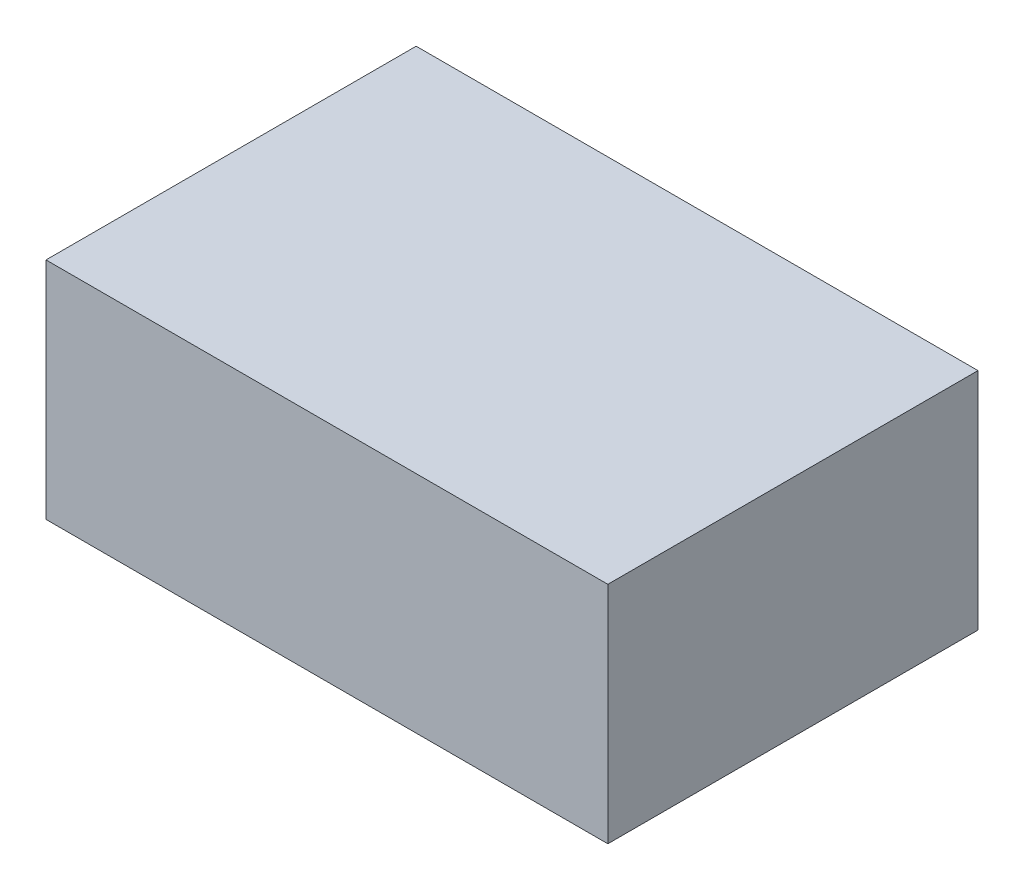
ISO-10303-21;
HEADER;
FILE_DESCRIPTION(('STEP AP214'),'2;1');
FILE_NAME('part.step','',(''),(''),'','','');
FILE_SCHEMA(('AUTOMOTIVE_DESIGN { 1 0 10303 214 1 1 1 1 }'));
ENDSEC;
DATA;
#1=APPLICATION_CONTEXT('core data for automotive mechanical design processes');
#2=APPLICATION_PROTOCOL_DEFINITION('international standard','automotive_design',2000,#1);
#3=PRODUCT_CONTEXT('',#1,'mechanical');
#4=PRODUCT('Part','Part','',(#3));
#5=PRODUCT_RELATED_PRODUCT_CATEGORY('part','',(#4));
#6=PRODUCT_DEFINITION_FORMATION('','',#4);
#7=PRODUCT_DEFINITION_CONTEXT('part definition',#1,'design');
#8=PRODUCT_DEFINITION('design','',#6,#7);
#9=PRODUCT_DEFINITION_SHAPE('','',#8);
#10=(LENGTH_UNIT() NAMED_UNIT(*) SI_UNIT(.MILLI.,.METRE.));
#11=(NAMED_UNIT(*) PLANE_ANGLE_UNIT() SI_UNIT($,.RADIAN.));
#12=(NAMED_UNIT(*) SI_UNIT($,.STERADIAN.) SOLID_ANGLE_UNIT());
#13=UNCERTAINTY_MEASURE_WITH_UNIT(LENGTH_MEASURE(1.E-05),#10,'distance_accuracy_value','');
#14=(GEOMETRIC_REPRESENTATION_CONTEXT(3) GLOBAL_UNCERTAINTY_ASSIGNED_CONTEXT((#13)) GLOBAL_UNIT_ASSIGNED_CONTEXT((#10,
#11,#12)) REPRESENTATION_CONTEXT('',''));
#15=CARTESIAN_POINT('',(0.,0.,0.));
#16=DIRECTION('',(0.,0.,1.));
#17=DIRECTION('',(1.,0.,0.));
#18=AXIS2_PLACEMENT_3D('',#15,#16,#17);
#19=CARTESIAN_POINT('',(42.5,34.,28.));
#20=DIRECTION('',(-1.,0.,0.));
#21=DIRECTION('',(0.,0.,1.));
#22=AXIS2_PLACEMENT_3D('',#19,#20,#21);
#23=PLANE('',#22);
#24=DIRECTION('',(0.,0.,-1.));
#25=VECTOR('',#24,1.);
#26=CARTESIAN_POINT('',(42.5,0.,28.));
#27=LINE('',#26,#25);
#28=CARTESIAN_POINT('',(42.5,0.,28.));
#29=VERTEX_POINT('',#28);
#30=CARTESIAN_POINT('',(42.5,0.,-28.));
#31=VERTEX_POINT('',#30);
#32=EDGE_CURVE('E111',#29,#31,#27,.T.);
#33=ORIENTED_EDGE('',*,*,#32,.T.);
#34=DIRECTION('',(0.,-1.,0.));
#35=VECTOR('',#34,1.);
#36=CARTESIAN_POINT('',(42.5,34.,-28.));
#37=LINE('',#36,#35);
#38=CARTESIAN_POINT('',(42.5,34.,-28.));
#39=VERTEX_POINT('',#38);
#40=EDGE_CURVE('E11',#39,#31,#37,.T.);
#41=ORIENTED_EDGE('',*,*,#40,.F.);
#42=DIRECTION('',(0.,0.,-1.));
#43=VECTOR('',#42,1.);
#44=CARTESIAN_POINT('',(42.5,34.,28.));
#45=LINE('',#44,#43);
#46=CARTESIAN_POINT('',(42.5,34.,28.));
#47=VERTEX_POINT('',#46);
#48=EDGE_CURVE('E95',#47,#39,#45,.T.);
#49=ORIENTED_EDGE('',*,*,#48,.F.);
#50=DIRECTION('',(0.,-1.,0.));
#51=VECTOR('',#50,1.);
#52=CARTESIAN_POINT('',(42.5,34.,28.));
#53=LINE('',#52,#51);
#54=EDGE_CURVE('E107',#47,#29,#53,.T.);
#55=ORIENTED_EDGE('',*,*,#54,.T.);
#56=EDGE_LOOP('',(#33,#41,#49,#55));
#57=FACE_BOUND('',#56,.T.);
#58=ADVANCED_FACE('F43',(#57),#23,.F.);
#59=CARTESIAN_POINT('',(-42.5,34.,-28.));
#60=DIRECTION('',(0.,0.,1.));
#61=DIRECTION('',(1.,0.,0.));
#62=AXIS2_PLACEMENT_3D('',#59,#60,#61);
#63=PLANE('',#62);
#64=DIRECTION('',(-1.,0.,0.));
#65=VECTOR('',#64,1.);
#66=CARTESIAN_POINT('',(-42.5,0.,-28.));
#67=LINE('',#66,#65);
#68=CARTESIAN_POINT('',(-42.5,0.,-28.));
#69=VERTEX_POINT('',#68);
#70=EDGE_CURVE('E100',#31,#69,#67,.T.);
#71=ORIENTED_EDGE('',*,*,#70,.T.);
#72=DIRECTION('',(0.,-1.,0.));
#73=VECTOR('',#72,1.);
#74=CARTESIAN_POINT('',(-42.5,34.,-28.));
#75=LINE('',#74,#73);
#76=CARTESIAN_POINT('',(-42.5,34.,-28.));
#77=VERTEX_POINT('',#76);
#78=EDGE_CURVE('E52',#77,#69,#75,.T.);
#79=ORIENTED_EDGE('',*,*,#78,.F.);
#80=DIRECTION('',(-1.,0.,0.));
#81=VECTOR('',#80,1.);
#82=CARTESIAN_POINT('',(-42.5,34.,-28.));
#83=LINE('',#82,#81);
#84=EDGE_CURVE('E90',#39,#77,#83,.T.);
#85=ORIENTED_EDGE('',*,*,#84,.F.);
#86=ORIENTED_EDGE('',*,*,#40,.T.);
#87=EDGE_LOOP('',(#71,#79,#85,#86));
#88=FACE_BOUND('',#87,.T.);
#89=ADVANCED_FACE('F99',(#88),#63,.F.);
#90=CARTESIAN_POINT('',(-42.5,34.,28.));
#91=DIRECTION('',(1.,0.,0.));
#92=DIRECTION('',(0.,0.,-1.));
#93=AXIS2_PLACEMENT_3D('',#90,#91,#92);
#94=PLANE('',#93);
#95=DIRECTION('',(0.,0.,1.));
#96=VECTOR('',#95,1.);
#97=CARTESIAN_POINT('',(-42.5,0.,28.));
#98=LINE('',#97,#96);
#99=CARTESIAN_POINT('',(-42.5,0.,28.));
#100=VERTEX_POINT('',#99);
#101=EDGE_CURVE('E77',#69,#100,#98,.T.);
#102=ORIENTED_EDGE('',*,*,#101,.T.);
#103=DIRECTION('',(0.,-1.,0.));
#104=VECTOR('',#103,1.);
#105=CARTESIAN_POINT('',(-42.5,34.,28.));
#106=LINE('',#105,#104);
#107=CARTESIAN_POINT('',(-42.5,34.,28.));
#108=VERTEX_POINT('',#107);
#109=EDGE_CURVE('E102',#108,#100,#106,.T.);
#110=ORIENTED_EDGE('',*,*,#109,.F.);
#111=DIRECTION('',(0.,0.,1.));
#112=VECTOR('',#111,1.);
#113=CARTESIAN_POINT('',(-42.5,34.,28.));
#114=LINE('',#113,#112);
#115=EDGE_CURVE('E93',#77,#108,#114,.T.);
#116=ORIENTED_EDGE('',*,*,#115,.F.);
#117=ORIENTED_EDGE('',*,*,#78,.T.);
#118=EDGE_LOOP('',(#102,#110,#116,#117));
#119=FACE_BOUND('',#118,.T.);
#120=ADVANCED_FACE('F103',(#119),#94,.F.);
#121=CARTESIAN_POINT('',(-42.5,34.,28.));
#122=DIRECTION('',(0.,0.,-1.));
#123=DIRECTION('',(-1.,0.,0.));
#124=AXIS2_PLACEMENT_3D('',#121,#122,#123);
#125=PLANE('',#124);
#126=DIRECTION('',(1.,0.,0.));
#127=VECTOR('',#126,1.);
#128=CARTESIAN_POINT('',(-42.5,0.,28.));
#129=LINE('',#128,#127);
#130=EDGE_CURVE('E83',#100,#29,#129,.T.);
#131=ORIENTED_EDGE('',*,*,#130,.T.);
#132=ORIENTED_EDGE('',*,*,#54,.F.);
#133=DIRECTION('',(1.,0.,0.));
#134=VECTOR('',#133,1.);
#135=CARTESIAN_POINT('',(-42.5,34.,28.));
#136=LINE('',#135,#134);
#137=EDGE_CURVE('E60',#108,#47,#136,.T.);
#138=ORIENTED_EDGE('',*,*,#137,.F.);
#139=ORIENTED_EDGE('',*,*,#109,.T.);
#140=EDGE_LOOP('',(#131,#132,#138,#139));
#141=FACE_BOUND('',#140,.T.);
#142=ADVANCED_FACE('F124',(#141),#125,.F.);
#143=CARTESIAN_POINT('',(0.,34.,0.));
#144=DIRECTION('',(0.,-1.,0.));
#145=DIRECTION('',(0.,0.,-1.));
#146=AXIS2_PLACEMENT_3D('',#143,#144,#145);
#147=PLANE('',#146);
#148=ORIENTED_EDGE('',*,*,#48,.T.);
#149=ORIENTED_EDGE('',*,*,#84,.T.);
#150=ORIENTED_EDGE('',*,*,#115,.T.);
#151=ORIENTED_EDGE('',*,*,#137,.T.);
#152=EDGE_LOOP('',(#148,#149,#150,#151));
#153=FACE_BOUND('',#152,.T.);
#154=ADVANCED_FACE('F91',(#153),#147,.F.);
#155=CARTESIAN_POINT('',(0.,0.,0.));
#156=DIRECTION('',(0.,-1.,0.));
#157=DIRECTION('',(0.,0.,-1.));
#158=AXIS2_PLACEMENT_3D('',#155,#156,#157);
#159=PLANE('',#158);
#160=ORIENTED_EDGE('',*,*,#32,.F.);
#161=ORIENTED_EDGE('',*,*,#130,.F.);
#162=ORIENTED_EDGE('',*,*,#101,.F.);
#163=ORIENTED_EDGE('',*,*,#70,.F.);
#164=EDGE_LOOP('',(#160,#161,#162,#163));
#165=FACE_BOUND('',#164,.T.);
#166=ADVANCED_FACE('F127',(#165),#159,.T.);
#167=CLOSED_SHELL('',(#58,#89,#120,#142,#154,#166));
#168=MANIFOLD_SOLID_BREP('B2',#167);
#169=ADVANCED_BREP_SHAPE_REPRESENTATION('',(#18,#168),#14);
#170=SHAPE_DEFINITION_REPRESENTATION(#9,#169);
ENDSEC;
END-ISO-10303-21;
